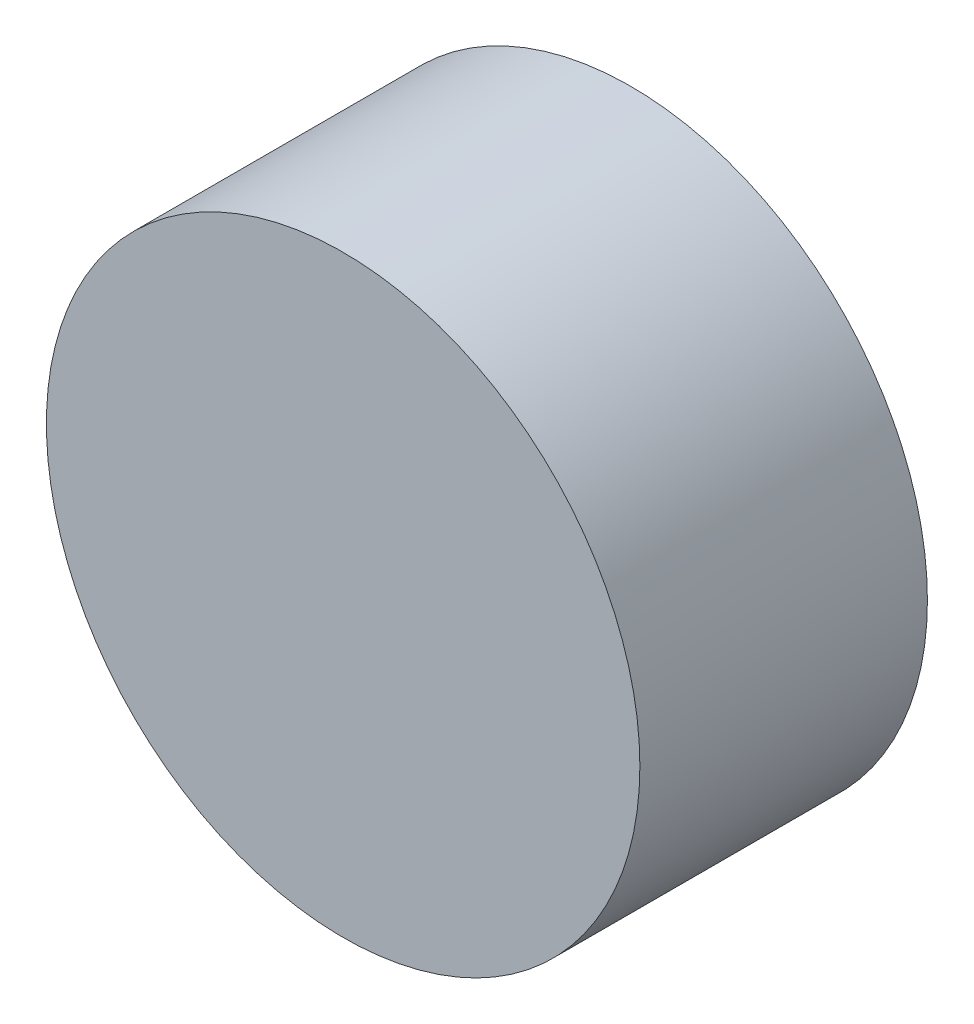
ISO-10303-21;
HEADER;
FILE_DESCRIPTION(('STEP AP214'),'2;1');
FILE_NAME('part.step','',(''),(''),'','','');
FILE_SCHEMA(('AUTOMOTIVE_DESIGN { 1 0 10303 214 1 1 1 1 }'));
ENDSEC;
DATA;
#1=APPLICATION_CONTEXT('core data for automotive mechanical design processes');
#2=APPLICATION_PROTOCOL_DEFINITION('international standard','automotive_design',2000,#1);
#3=PRODUCT_CONTEXT('',#1,'mechanical');
#4=PRODUCT('Part','Part','',(#3));
#5=PRODUCT_RELATED_PRODUCT_CATEGORY('part','',(#4));
#6=PRODUCT_DEFINITION_FORMATION('','',#4);
#7=PRODUCT_DEFINITION_CONTEXT('part definition',#1,'design');
#8=PRODUCT_DEFINITION('design','',#6,#7);
#9=PRODUCT_DEFINITION_SHAPE('','',#8);
#10=(LENGTH_UNIT() NAMED_UNIT(*) SI_UNIT(.MILLI.,.METRE.));
#11=(NAMED_UNIT(*) PLANE_ANGLE_UNIT() SI_UNIT($,.RADIAN.));
#12=(NAMED_UNIT(*) SI_UNIT($,.STERADIAN.) SOLID_ANGLE_UNIT());
#13=UNCERTAINTY_MEASURE_WITH_UNIT(LENGTH_MEASURE(1.E-05),#10,'distance_accuracy_value','');
#14=(GEOMETRIC_REPRESENTATION_CONTEXT(3) GLOBAL_UNCERTAINTY_ASSIGNED_CONTEXT((#13)) GLOBAL_UNIT_ASSIGNED_CONTEXT((#10,
#11,#12)) REPRESENTATION_CONTEXT('',''));
#15=CARTESIAN_POINT('',(0.,0.,0.));
#16=DIRECTION('',(0.,0.,1.));
#17=DIRECTION('',(1.,0.,0.));
#18=AXIS2_PLACEMENT_3D('',#15,#16,#17);
#19=CARTESIAN_POINT('',(0.,0.,3.175));
#20=DIRECTION('',(0.,0.,-1.));
#21=DIRECTION('',(-1.,0.,0.));
#22=AXIS2_PLACEMENT_3D('',#19,#20,#21);
#23=CYLINDRICAL_SURFACE('',#22,3.2766);
#24=CARTESIAN_POINT('',(0.,0.,3.175));
#25=DIRECTION('',(0.,0.,1.));
#26=DIRECTION('',(1.,0.,0.));
#27=AXIS2_PLACEMENT_3D('',#24,#25,#26);
#28=CIRCLE('',#27,3.2766);
#29=CARTESIAN_POINT('',(3.2766,0.,3.175));
#30=VERTEX_POINT('',#29);
#31=EDGE_CURVE('E11',#30,#30,#28,.T.);
#32=ORIENTED_EDGE('',*,*,#31,.F.);
#33=EDGE_LOOP('',(#32));
#34=FACE_BOUND('',#33,.T.);
#35=CARTESIAN_POINT('',(0.,0.,0.));
#36=DIRECTION('',(0.,0.,1.));
#37=DIRECTION('',(1.,0.,0.));
#38=AXIS2_PLACEMENT_3D('',#35,#36,#37);
#39=CIRCLE('',#38,3.2766);
#40=CARTESIAN_POINT('',(3.2766,0.,0.));
#41=VERTEX_POINT('',#40);
#42=EDGE_CURVE('E40',#41,#41,#39,.T.);
#43=ORIENTED_EDGE('',*,*,#42,.T.);
#44=EDGE_LOOP('',(#43));
#45=FACE_BOUND('',#44,.T.);
#46=ADVANCED_FACE('F37',(#34,#45),#23,.T.);
#47=CARTESIAN_POINT('',(0.,0.,3.175));
#48=DIRECTION('',(0.,0.,1.));
#49=DIRECTION('',(1.,0.,0.));
#50=AXIS2_PLACEMENT_3D('',#47,#48,#49);
#51=PLANE('',#50);
#52=ORIENTED_EDGE('',*,*,#31,.T.);
#53=EDGE_LOOP('',(#52));
#54=FACE_BOUND('',#53,.T.);
#55=ADVANCED_FACE('F54',(#54),#51,.T.);
#56=CARTESIAN_POINT('',(0.,0.,0.));
#57=DIRECTION('',(0.,0.,1.));
#58=DIRECTION('',(1.,0.,0.));
#59=AXIS2_PLACEMENT_3D('',#56,#57,#58);
#60=PLANE('',#59);
#61=ORIENTED_EDGE('',*,*,#42,.F.);
#62=EDGE_LOOP('',(#61));
#63=FACE_BOUND('',#62,.T.);
#64=ADVANCED_FACE('F52',(#63),#60,.F.);
#65=CLOSED_SHELL('',(#46,#55,#64));
#66=MANIFOLD_SOLID_BREP('B2',#65);
#67=ADVANCED_BREP_SHAPE_REPRESENTATION('',(#18,#66),#14);
#68=SHAPE_DEFINITION_REPRESENTATION(#9,#67);
ENDSEC;
END-ISO-10303-21;
